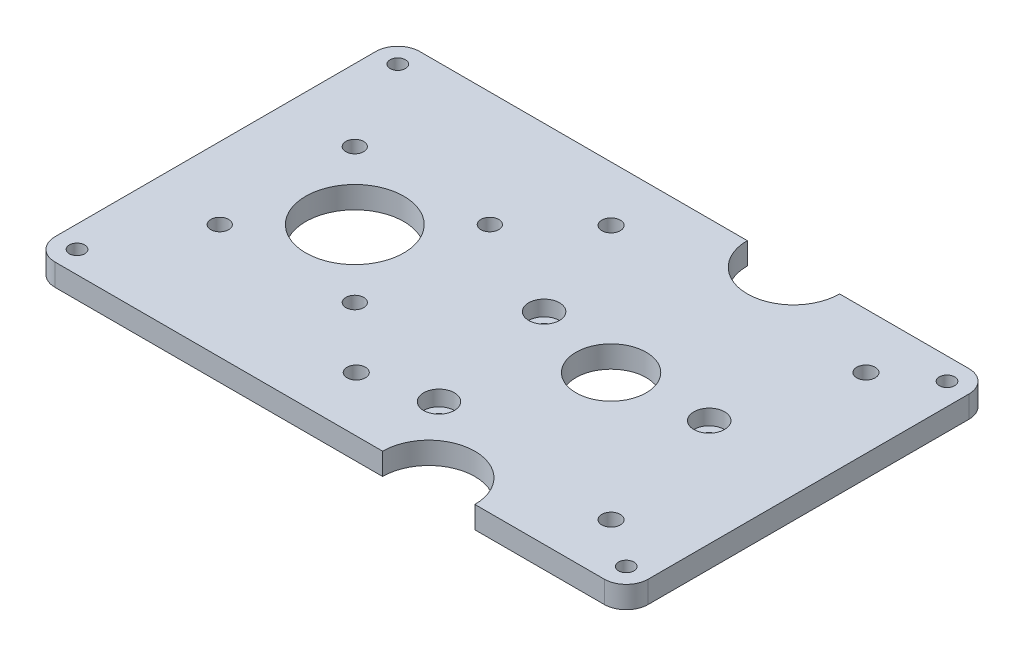
ISO-10303-21;
HEADER;
FILE_DESCRIPTION(('STEP AP214'),'2;1');
FILE_NAME('part.step','',(''),(''),'','','');
FILE_SCHEMA(('AUTOMOTIVE_DESIGN { 1 0 10303 214 1 1 1 1 }'));
ENDSEC;
DATA;
#1=APPLICATION_CONTEXT('core data for automotive mechanical design processes');
#2=APPLICATION_PROTOCOL_DEFINITION('international standard','automotive_design',2000,#1);
#3=PRODUCT_CONTEXT('',#1,'mechanical');
#4=PRODUCT('Part','Part','',(#3));
#5=PRODUCT_RELATED_PRODUCT_CATEGORY('part','',(#4));
#6=PRODUCT_DEFINITION_FORMATION('','',#4);
#7=PRODUCT_DEFINITION_CONTEXT('part definition',#1,'design');
#8=PRODUCT_DEFINITION('design','',#6,#7);
#9=PRODUCT_DEFINITION_SHAPE('','',#8);
#10=(LENGTH_UNIT() NAMED_UNIT(*) SI_UNIT(.MILLI.,.METRE.));
#11=(NAMED_UNIT(*) PLANE_ANGLE_UNIT() SI_UNIT($,.RADIAN.));
#12=(NAMED_UNIT(*) SI_UNIT($,.STERADIAN.) SOLID_ANGLE_UNIT());
#13=UNCERTAINTY_MEASURE_WITH_UNIT(LENGTH_MEASURE(1.E-05),#10,'distance_accuracy_value','');
#14=(GEOMETRIC_REPRESENTATION_CONTEXT(3) GLOBAL_UNCERTAINTY_ASSIGNED_CONTEXT((#13)) GLOBAL_UNIT_ASSIGNED_CONTEXT((#10,
#11,#12)) REPRESENTATION_CONTEXT('',''));
#15=CARTESIAN_POINT('',(0.,0.,0.));
#16=DIRECTION('',(0.,0.,1.));
#17=DIRECTION('',(1.,0.,0.));
#18=AXIS2_PLACEMENT_3D('',#15,#16,#17);
#19=CARTESIAN_POINT('',(8.69931970046473,-5.,25.3178513796003));
#20=DIRECTION('',(0.,1.,0.));
#21=DIRECTION('',(0.,0.,1.));
#22=AXIS2_PLACEMENT_3D('',#19,#20,#21);
#23=CYLINDRICAL_SURFACE('',#22,1.65);
#24=CARTESIAN_POINT('',(8.69931970046473,0.,25.3178513796003));
#25=DIRECTION('',(0.,1.,0.));
#26=DIRECTION('',(0.,0.,1.));
#27=AXIS2_PLACEMENT_3D('',#24,#25,#26);
#28=CIRCLE('',#27,1.65);
#29=CARTESIAN_POINT('',(8.69931970046473,0.,26.9678513796003));
#30=VERTEX_POINT('',#29);
#31=EDGE_CURVE('E313',#30,#30,#28,.T.);
#32=ORIENTED_EDGE('',*,*,#31,.F.);
#33=EDGE_LOOP('',(#32));
#34=FACE_BOUND('',#33,.T.);
#35=CARTESIAN_POINT('',(8.69931970046473,1.5,25.3178513796003));
#36=DIRECTION('',(0.,1.,0.));
#37=DIRECTION('',(0.,0.,1.));
#38=AXIS2_PLACEMENT_3D('',#35,#36,#37);
#39=CIRCLE('',#38,1.65);
#40=CARTESIAN_POINT('',(8.69931970046473,1.5,26.9678513796003));
#41=VERTEX_POINT('',#40);
#42=EDGE_CURVE('E362',#41,#41,#39,.F.);
#43=ORIENTED_EDGE('',*,*,#42,.F.);
#44=EDGE_LOOP('',(#43));
#45=FACE_BOUND('',#44,.T.);
#46=ADVANCED_FACE('F39',(#34,#45),#23,.F.);
#47=CARTESIAN_POINT('',(2.92152234437952,-5.,-4.38401529104274));
#48=DIRECTION('',(0.,1.,0.));
#49=DIRECTION('',(0.,0.,1.));
#50=AXIS2_PLACEMENT_3D('',#47,#48,#49);
#51=CYLINDRICAL_SURFACE('',#50,1.65);
#52=CARTESIAN_POINT('',(2.92152234437952,0.,-4.38401529104274));
#53=DIRECTION('',(0.,1.,0.));
#54=DIRECTION('',(0.,0.,1.));
#55=AXIS2_PLACEMENT_3D('',#52,#53,#54);
#56=CIRCLE('',#55,1.65);
#57=CARTESIAN_POINT('',(2.92152234437952,0.,-2.73401529104274));
#58=VERTEX_POINT('',#57);
#59=EDGE_CURVE('E315',#58,#58,#56,.T.);
#60=ORIENTED_EDGE('',*,*,#59,.F.);
#61=EDGE_LOOP('',(#60));
#62=FACE_BOUND('',#61,.T.);
#63=CARTESIAN_POINT('',(2.92152234437952,1.5,-4.38401529104274));
#64=DIRECTION('',(0.,1.,0.));
#65=DIRECTION('',(0.,0.,1.));
#66=AXIS2_PLACEMENT_3D('',#63,#64,#65);
#67=CIRCLE('',#66,1.65);
#68=CARTESIAN_POINT('',(2.92152234437952,1.5,-2.73401529104274));
#69=VERTEX_POINT('',#68);
#70=EDGE_CURVE('E345',#69,#69,#67,.F.);
#71=ORIENTED_EDGE('',*,*,#70,.F.);
#72=EDGE_LOOP('',(#71));
#73=FACE_BOUND('',#72,.T.);
#74=ADVANCED_FACE('F328',(#62,#73),#51,.F.);
#75=CARTESIAN_POINT('',(43.1993197004647,-5.,-1.68214862039967));
#76=DIRECTION('',(0.,1.,0.));
#77=DIRECTION('',(0.,0.,1.));
#78=AXIS2_PLACEMENT_3D('',#75,#76,#77);
#79=CYLINDRICAL_SURFACE('',#78,1.65);
#80=CARTESIAN_POINT('',(43.1993197004647,0.,-1.68214862039967));
#81=DIRECTION('',(0.,1.,0.));
#82=DIRECTION('',(0.,0.,1.));
#83=AXIS2_PLACEMENT_3D('',#80,#81,#82);
#84=CIRCLE('',#83,1.65);
#85=CARTESIAN_POINT('',(43.1993197004647,0.,-0.0321486203996718));
#86=VERTEX_POINT('',#85);
#87=EDGE_CURVE('E43',#86,#86,#84,.T.);
#88=ORIENTED_EDGE('',*,*,#87,.F.);
#89=EDGE_LOOP('',(#88));
#90=FACE_BOUND('',#89,.T.);
#91=CARTESIAN_POINT('',(43.1993197004647,1.5,-1.68214862039967));
#92=DIRECTION('',(0.,1.,0.));
#93=DIRECTION('',(0.,0.,1.));
#94=AXIS2_PLACEMENT_3D('',#91,#92,#93);
#95=CIRCLE('',#94,1.65);
#96=CARTESIAN_POINT('',(43.1993197004647,1.5,-0.0321486203996718));
#97=VERTEX_POINT('',#96);
#98=EDGE_CURVE('E332',#97,#97,#95,.F.);
#99=ORIENTED_EDGE('',*,*,#98,.F.);
#100=EDGE_LOOP('',(#99));
#101=FACE_BOUND('',#100,.T.);
#102=ADVANCED_FACE('F325',(#90,#101),#79,.F.);
#103=CARTESIAN_POINT('',(22.5500000000001,5.,-41.5));
#104=DIRECTION('',(0.,-1.,0.));
#105=DIRECTION('',(0.,0.,-1.));
#106=AXIS2_PLACEMENT_3D('',#103,#104,#105);
#107=CYLINDRICAL_SURFACE('',#106,10.5);
#108=CARTESIAN_POINT('',(22.5500000000001,0.,-41.5));
#109=DIRECTION('',(0.,1.,0.));
#110=DIRECTION('',(0.,0.,1.));
#111=AXIS2_PLACEMENT_3D('',#108,#109,#110);
#112=CIRCLE('',#111,10.5);
#113=CARTESIAN_POINT('',(12.0500000000001,0.,-41.5));
#114=VERTEX_POINT('',#113);
#115=CARTESIAN_POINT('',(33.0500000000001,0.,-41.5));
#116=VERTEX_POINT('',#115);
#117=EDGE_CURVE('E139',#114,#116,#112,.T.);
#118=ORIENTED_EDGE('',*,*,#117,.F.);
#119=DIRECTION('',(0.,-1.,0.));
#120=VECTOR('',#119,1.);
#121=CARTESIAN_POINT('',(12.0500000000001,5.,-41.5));
#122=LINE('',#121,#120);
#123=CARTESIAN_POINT('',(12.0500000000001,5.,-41.5));
#124=VERTEX_POINT('',#123);
#125=EDGE_CURVE('E132',#124,#114,#122,.T.);
#126=ORIENTED_EDGE('',*,*,#125,.F.);
#127=CARTESIAN_POINT('',(22.5500000000001,5.,-41.5));
#128=DIRECTION('',(0.,1.,0.));
#129=DIRECTION('',(0.,0.,1.));
#130=AXIS2_PLACEMENT_3D('',#127,#128,#129);
#131=CIRCLE('',#130,10.5);
#132=CARTESIAN_POINT('',(33.0500000000001,5.,-41.5));
#133=VERTEX_POINT('',#132);
#134=EDGE_CURVE('E137',#124,#133,#131,.T.);
#135=ORIENTED_EDGE('',*,*,#134,.T.);
#136=DIRECTION('',(0.,-1.,0.));
#137=VECTOR('',#136,1.);
#138=CARTESIAN_POINT('',(33.0500000000001,5.,-41.5));
#139=LINE('',#138,#137);
#140=EDGE_CURVE('E223',#133,#116,#139,.T.);
#141=ORIENTED_EDGE('',*,*,#140,.T.);
#142=EDGE_LOOP('',(#118,#126,#135,#141));
#143=FACE_BOUND('',#142,.T.);
#144=ADVANCED_FACE('F134',(#143),#107,.F.);
#145=CARTESIAN_POINT('',(0.,5.,-41.5));
#146=DIRECTION('',(0.,0.,1.));
#147=DIRECTION('',(1.,0.,0.));
#148=AXIS2_PLACEMENT_3D('',#145,#146,#147);
#149=PLANE('',#148);
#150=DIRECTION('',(-1.,0.,0.));
#151=VECTOR('',#150,1.);
#152=CARTESIAN_POINT('',(0.,0.,-41.5));
#153=LINE('',#152,#151);
#154=CARTESIAN_POINT('',(-62.5,0.,-41.5));
#155=VERTEX_POINT('',#154);
#156=EDGE_CURVE('E225',#114,#155,#153,.T.);
#157=ORIENTED_EDGE('',*,*,#156,.T.);
#158=DIRECTION('',(0.,-1.,0.));
#159=VECTOR('',#158,1.);
#160=CARTESIAN_POINT('',(-62.5,5.,-41.5));
#161=LINE('',#160,#159);
#162=CARTESIAN_POINT('',(-62.5,5.,-41.5));
#163=VERTEX_POINT('',#162);
#164=EDGE_CURVE('E150',#155,#163,#161,.F.);
#165=ORIENTED_EDGE('',*,*,#164,.T.);
#166=DIRECTION('',(-1.,0.,0.));
#167=VECTOR('',#166,1.);
#168=CARTESIAN_POINT('',(0.,5.,-41.5));
#169=LINE('',#168,#167);
#170=EDGE_CURVE('E147',#124,#163,#169,.T.);
#171=ORIENTED_EDGE('',*,*,#170,.F.);
#172=ORIENTED_EDGE('',*,*,#125,.T.);
#173=EDGE_LOOP('',(#157,#165,#171,#172));
#174=FACE_BOUND('',#173,.T.);
#175=ADVANCED_FACE('F148',(#174),#149,.F.);
#176=CARTESIAN_POINT('',(-67.5,5.,0.));
#177=DIRECTION('',(-1.,0.,0.));
#178=DIRECTION('',(0.,0.,1.));
#179=AXIS2_PLACEMENT_3D('',#176,#177,#178);
#180=PLANE('',#179);
#181=DIRECTION('',(0.,0.,-1.));
#182=VECTOR('',#181,1.);
#183=CARTESIAN_POINT('',(-67.5,0.,0.));
#184=LINE('',#183,#182);
#185=CARTESIAN_POINT('',(-67.5,0.,36.5));
#186=VERTEX_POINT('',#185);
#187=CARTESIAN_POINT('',(-67.5,0.,-36.5));
#188=VERTEX_POINT('',#187);
#189=EDGE_CURVE('E227',#186,#188,#184,.T.);
#190=ORIENTED_EDGE('',*,*,#189,.F.);
#191=DIRECTION('',(0.,-1.,0.));
#192=VECTOR('',#191,1.);
#193=CARTESIAN_POINT('',(-67.5,5.,36.5));
#194=LINE('',#193,#192);
#195=CARTESIAN_POINT('',(-67.5,5.,36.5));
#196=VERTEX_POINT('',#195);
#197=EDGE_CURVE('E298',#186,#196,#194,.F.);
#198=ORIENTED_EDGE('',*,*,#197,.T.);
#199=DIRECTION('',(0.,0.,-1.));
#200=VECTOR('',#199,1.);
#201=CARTESIAN_POINT('',(-67.5,5.,0.));
#202=LINE('',#201,#200);
#203=CARTESIAN_POINT('',(-67.5,5.,-36.5));
#204=VERTEX_POINT('',#203);
#205=EDGE_CURVE('E152',#196,#204,#202,.T.);
#206=ORIENTED_EDGE('',*,*,#205,.T.);
#207=DIRECTION('',(0.,-1.,0.));
#208=VECTOR('',#207,1.);
#209=CARTESIAN_POINT('',(-67.5,0.,-36.5));
#210=LINE('',#209,#208);
#211=EDGE_CURVE('E295',#204,#188,#210,.T.);
#212=ORIENTED_EDGE('',*,*,#211,.T.);
#213=EDGE_LOOP('',(#190,#198,#206,#212));
#214=FACE_BOUND('',#213,.T.);
#215=ADVANCED_FACE('F699',(#214),#180,.T.);
#216=CARTESIAN_POINT('',(0.,5.,41.5));
#217=DIRECTION('',(0.,0.,1.));
#218=DIRECTION('',(1.,0.,0.));
#219=AXIS2_PLACEMENT_3D('',#216,#217,#218);
#220=PLANE('',#219);
#221=DIRECTION('',(-1.,0.,0.));
#222=VECTOR('',#221,1.);
#223=CARTESIAN_POINT('',(0.,5.,41.5));
#224=LINE('',#223,#222);
#225=CARTESIAN_POINT('',(12.0500000000001,5.,41.5));
#226=VERTEX_POINT('',#225);
#227=CARTESIAN_POINT('',(-62.5,5.,41.5));
#228=VERTEX_POINT('',#227);
#229=EDGE_CURVE('E170',#226,#228,#224,.T.);
#230=ORIENTED_EDGE('',*,*,#229,.T.);
#231=DIRECTION('',(0.,-1.,0.));
#232=VECTOR('',#231,1.);
#233=CARTESIAN_POINT('',(-62.5,5.,41.5));
#234=LINE('',#233,#232);
#235=CARTESIAN_POINT('',(-62.5,0.,41.5));
#236=VERTEX_POINT('',#235);
#237=EDGE_CURVE('E143',#228,#236,#234,.T.);
#238=ORIENTED_EDGE('',*,*,#237,.T.);
#239=DIRECTION('',(-1.,0.,0.));
#240=VECTOR('',#239,1.);
#241=CARTESIAN_POINT('',(0.,0.,41.5));
#242=LINE('',#241,#240);
#243=CARTESIAN_POINT('',(12.0500000000001,0.,41.5));
#244=VERTEX_POINT('',#243);
#245=EDGE_CURVE('E230',#244,#236,#242,.T.);
#246=ORIENTED_EDGE('',*,*,#245,.F.);
#247=DIRECTION('',(0.,-1.,0.));
#248=VECTOR('',#247,1.);
#249=CARTESIAN_POINT('',(12.0500000000001,5.,41.5));
#250=LINE('',#249,#248);
#251=EDGE_CURVE('E144',#226,#244,#250,.T.);
#252=ORIENTED_EDGE('',*,*,#251,.F.);
#253=EDGE_LOOP('',(#230,#238,#246,#252));
#254=FACE_BOUND('',#253,.T.);
#255=ADVANCED_FACE('F688',(#254),#220,.T.);
#256=CARTESIAN_POINT('',(22.5500000000001,5.,41.5));
#257=DIRECTION('',(0.,-1.,0.));
#258=DIRECTION('',(0.,0.,-1.));
#259=AXIS2_PLACEMENT_3D('',#256,#257,#258);
#260=CYLINDRICAL_SURFACE('',#259,10.5);
#261=CARTESIAN_POINT('',(22.5500000000001,0.,41.5));
#262=DIRECTION('',(0.,1.,0.));
#263=DIRECTION('',(0.,0.,1.));
#264=AXIS2_PLACEMENT_3D('',#261,#262,#263);
#265=CIRCLE('',#264,10.5);
#266=CARTESIAN_POINT('',(33.0500000000001,0.,41.5));
#267=VERTEX_POINT('',#266);
#268=EDGE_CURVE('E233',#267,#244,#265,.T.);
#269=ORIENTED_EDGE('',*,*,#268,.F.);
#270=DIRECTION('',(0.,-1.,0.));
#271=VECTOR('',#270,1.);
#272=CARTESIAN_POINT('',(33.0500000000001,5.,41.5));
#273=LINE('',#272,#271);
#274=CARTESIAN_POINT('',(33.0500000000001,5.,41.5));
#275=VERTEX_POINT('',#274);
#276=EDGE_CURVE('E281',#275,#267,#273,.T.);
#277=ORIENTED_EDGE('',*,*,#276,.F.);
#278=CARTESIAN_POINT('',(22.5500000000001,5.,41.5));
#279=DIRECTION('',(0.,1.,0.));
#280=DIRECTION('',(0.,0.,1.));
#281=AXIS2_PLACEMENT_3D('',#278,#279,#280);
#282=CIRCLE('',#281,10.5);
#283=EDGE_CURVE('E173',#275,#226,#282,.T.);
#284=ORIENTED_EDGE('',*,*,#283,.T.);
#285=ORIENTED_EDGE('',*,*,#251,.T.);
#286=EDGE_LOOP('',(#269,#277,#284,#285));
#287=FACE_BOUND('',#286,.T.);
#288=ADVANCED_FACE('F677',(#287),#260,.F.);
#289=CARTESIAN_POINT('',(0.,5.,41.5));
#290=DIRECTION('',(0.,0.,1.));
#291=DIRECTION('',(1.,0.,0.));
#292=AXIS2_PLACEMENT_3D('',#289,#290,#291);
#293=PLANE('',#292);
#294=DIRECTION('',(-1.,0.,0.));
#295=VECTOR('',#294,1.);
#296=CARTESIAN_POINT('',(0.,0.,41.5));
#297=LINE('',#296,#295);
#298=CARTESIAN_POINT('',(62.5,0.,41.5));
#299=VERTEX_POINT('',#298);
#300=EDGE_CURVE('E236',#299,#267,#297,.T.);
#301=ORIENTED_EDGE('',*,*,#300,.F.);
#302=DIRECTION('',(0.,-1.,0.));
#303=VECTOR('',#302,1.);
#304=CARTESIAN_POINT('',(62.5,5.,41.5));
#305=LINE('',#304,#303);
#306=CARTESIAN_POINT('',(62.5,5.,41.5));
#307=VERTEX_POINT('',#306);
#308=EDGE_CURVE('E48',#299,#307,#305,.F.);
#309=ORIENTED_EDGE('',*,*,#308,.T.);
#310=DIRECTION('',(-1.,0.,0.));
#311=VECTOR('',#310,1.);
#312=CARTESIAN_POINT('',(0.,5.,41.5));
#313=LINE('',#312,#311);
#314=EDGE_CURVE('E176',#307,#275,#313,.T.);
#315=ORIENTED_EDGE('',*,*,#314,.T.);
#316=ORIENTED_EDGE('',*,*,#276,.T.);
#317=EDGE_LOOP('',(#301,#309,#315,#316));
#318=FACE_BOUND('',#317,.T.);
#319=ADVANCED_FACE('F667',(#318),#293,.T.);
#320=CARTESIAN_POINT('',(67.5,5.,0.));
#321=DIRECTION('',(-1.,0.,0.));
#322=DIRECTION('',(0.,0.,1.));
#323=AXIS2_PLACEMENT_3D('',#320,#321,#322);
#324=PLANE('',#323);
#325=DIRECTION('',(0.,0.,-1.));
#326=VECTOR('',#325,1.);
#327=CARTESIAN_POINT('',(67.5,5.,0.));
#328=LINE('',#327,#326);
#329=CARTESIAN_POINT('',(67.5,5.,36.5));
#330=VERTEX_POINT('',#329);
#331=CARTESIAN_POINT('',(67.5,5.,-36.5));
#332=VERTEX_POINT('',#331);
#333=EDGE_CURVE('E178',#330,#332,#328,.T.);
#334=ORIENTED_EDGE('',*,*,#333,.F.);
#335=DIRECTION('',(0.,-1.,0.));
#336=VECTOR('',#335,1.);
#337=CARTESIAN_POINT('',(67.5,0.,36.5));
#338=LINE('',#337,#336);
#339=CARTESIAN_POINT('',(67.5,0.,36.5));
#340=VERTEX_POINT('',#339);
#341=EDGE_CURVE('E309',#330,#340,#338,.T.);
#342=ORIENTED_EDGE('',*,*,#341,.T.);
#343=DIRECTION('',(0.,0.,-1.));
#344=VECTOR('',#343,1.);
#345=CARTESIAN_POINT('',(67.5,0.,0.));
#346=LINE('',#345,#344);
#347=CARTESIAN_POINT('',(67.5,0.,-36.5));
#348=VERTEX_POINT('',#347);
#349=EDGE_CURVE('E238',#340,#348,#346,.T.);
#350=ORIENTED_EDGE('',*,*,#349,.T.);
#351=DIRECTION('',(0.,-1.,0.));
#352=VECTOR('',#351,1.);
#353=CARTESIAN_POINT('',(67.5,5.,-36.5));
#354=LINE('',#353,#352);
#355=EDGE_CURVE('E64',#348,#332,#354,.F.);
#356=ORIENTED_EDGE('',*,*,#355,.T.);
#357=EDGE_LOOP('',(#334,#342,#350,#356));
#358=FACE_BOUND('',#357,.T.);
#359=ADVANCED_FACE('F656',(#358),#324,.F.);
#360=CARTESIAN_POINT('',(62.5,5.,36.5));
#361=DIRECTION('',(0.,-1.,0.));
#362=DIRECTION('',(0.,0.,-1.));
#363=AXIS2_PLACEMENT_3D('',#360,#361,#362);
#364=CYLINDRICAL_SURFACE('',#363,1.75);
#365=CARTESIAN_POINT('',(62.5,5.,36.5));
#366=DIRECTION('',(0.,1.,0.));
#367=DIRECTION('',(0.,0.,1.));
#368=AXIS2_PLACEMENT_3D('',#365,#366,#367);
#369=CIRCLE('',#368,1.75);
#370=CARTESIAN_POINT('',(62.5,5.,38.25));
#371=VERTEX_POINT('',#370);
#372=EDGE_CURVE('E217',#371,#371,#369,.T.);
#373=ORIENTED_EDGE('',*,*,#372,.T.);
#374=EDGE_LOOP('',(#373));
#375=FACE_BOUND('',#374,.T.);
#376=CARTESIAN_POINT('',(62.5,0.,36.5));
#377=DIRECTION('',(0.,1.,0.));
#378=DIRECTION('',(0.,0.,1.));
#379=AXIS2_PLACEMENT_3D('',#376,#377,#378);
#380=CIRCLE('',#379,1.75);
#381=CARTESIAN_POINT('',(62.5,0.,38.25));
#382=VERTEX_POINT('',#381);
#383=EDGE_CURVE('E162',#382,#382,#380,.T.);
#384=ORIENTED_EDGE('',*,*,#383,.F.);
#385=EDGE_LOOP('',(#384));
#386=FACE_BOUND('',#385,.T.);
#387=ADVANCED_FACE('F645',(#375,#386),#364,.F.);
#388=CARTESIAN_POINT('',(-35.78,5.,0.));
#389=DIRECTION('',(0.,-1.,0.));
#390=DIRECTION('',(0.,0.,-1.));
#391=AXIS2_PLACEMENT_3D('',#388,#389,#390);
#392=CYLINDRICAL_SURFACE('',#391,11.176);
#393=CARTESIAN_POINT('',(-35.78,5.,0.));
#394=DIRECTION('',(0.,1.,0.));
#395=DIRECTION('',(0.,0.,1.));
#396=AXIS2_PLACEMENT_3D('',#393,#394,#395);
#397=CIRCLE('',#396,11.176);
#398=CARTESIAN_POINT('',(-35.78,5.,11.176));
#399=VERTEX_POINT('',#398);
#400=EDGE_CURVE('E214',#399,#399,#397,.F.);
#401=ORIENTED_EDGE('',*,*,#400,.F.);
#402=EDGE_LOOP('',(#401));
#403=FACE_BOUND('',#402,.T.);
#404=CARTESIAN_POINT('',(-35.78,0.,0.));
#405=DIRECTION('',(0.,1.,0.));
#406=DIRECTION('',(0.,0.,1.));
#407=AXIS2_PLACEMENT_3D('',#404,#405,#406);
#408=CIRCLE('',#407,11.176);
#409=CARTESIAN_POINT('',(-35.78,0.,11.176));
#410=VERTEX_POINT('',#409);
#411=EDGE_CURVE('E275',#410,#410,#408,.F.);
#412=ORIENTED_EDGE('',*,*,#411,.T.);
#413=EDGE_LOOP('',(#412));
#414=FACE_BOUND('',#413,.T.);
#415=ADVANCED_FACE('F634',(#403,#414),#392,.F.);
#416=CARTESIAN_POINT('',(22.5500000000001,5.,0.));
#417=DIRECTION('',(0.,-1.,0.));
#418=DIRECTION('',(0.,0.,-1.));
#419=AXIS2_PLACEMENT_3D('',#416,#417,#418);
#420=CYLINDRICAL_SURFACE('',#419,8.00000000000001);
#421=CARTESIAN_POINT('',(22.5500000000001,5.,0.));
#422=DIRECTION('',(0.,1.,0.));
#423=DIRECTION('',(0.,0.,1.));
#424=AXIS2_PLACEMENT_3D('',#421,#422,#423);
#425=CIRCLE('',#424,8.00000000000001);
#426=CARTESIAN_POINT('',(22.5500000000001,5.,8.00000000000001));
#427=VERTEX_POINT('',#426);
#428=EDGE_CURVE('E211',#427,#427,#425,.T.);
#429=ORIENTED_EDGE('',*,*,#428,.T.);
#430=EDGE_LOOP('',(#429));
#431=FACE_BOUND('',#430,.T.);
#432=CARTESIAN_POINT('',(22.5500000000001,0.,0.));
#433=DIRECTION('',(0.,1.,0.));
#434=DIRECTION('',(0.,0.,1.));
#435=AXIS2_PLACEMENT_3D('',#432,#433,#434);
#436=CIRCLE('',#435,8.00000000000001);
#437=CARTESIAN_POINT('',(22.5500000000001,0.,8.00000000000001));
#438=VERTEX_POINT('',#437);
#439=EDGE_CURVE('E272',#438,#438,#436,.T.);
#440=ORIENTED_EDGE('',*,*,#439,.F.);
#441=EDGE_LOOP('',(#440));
#442=FACE_BOUND('',#441,.T.);
#443=ADVANCED_FACE('F623',(#431,#442),#420,.F.);
#444=CARTESIAN_POINT('',(-6.44999999999989,5.,29.));
#445=DIRECTION('',(0.,-1.,0.));
#446=DIRECTION('',(0.,0.,-1.));
#447=AXIS2_PLACEMENT_3D('',#444,#445,#446);
#448=CYLINDRICAL_SURFACE('',#447,2.09999999999999);
#449=CARTESIAN_POINT('',(-6.44999999999989,5.,29.));
#450=DIRECTION('',(0.,1.,0.));
#451=DIRECTION('',(0.,0.,1.));
#452=AXIS2_PLACEMENT_3D('',#449,#450,#451);
#453=CIRCLE('',#452,2.09999999999999);
#454=CARTESIAN_POINT('',(-6.44999999999989,5.,31.1));
#455=VERTEX_POINT('',#454);
#456=EDGE_CURVE('E208',#455,#455,#453,.T.);
#457=ORIENTED_EDGE('',*,*,#456,.T.);
#458=EDGE_LOOP('',(#457));
#459=FACE_BOUND('',#458,.T.);
#460=CARTESIAN_POINT('',(-6.44999999999989,0.,29.));
#461=DIRECTION('',(0.,1.,0.));
#462=DIRECTION('',(0.,0.,1.));
#463=AXIS2_PLACEMENT_3D('',#460,#461,#462);
#464=CIRCLE('',#463,2.09999999999999);
#465=CARTESIAN_POINT('',(-6.44999999999989,0.,31.1));
#466=VERTEX_POINT('',#465);
#467=EDGE_CURVE('E269',#466,#466,#464,.T.);
#468=ORIENTED_EDGE('',*,*,#467,.F.);
#469=EDGE_LOOP('',(#468));
#470=FACE_BOUND('',#469,.T.);
#471=ADVANCED_FACE('F612',(#459,#470),#448,.F.);
#472=CARTESIAN_POINT('',(51.5500000000001,5.,29.));
#473=DIRECTION('',(0.,-1.,0.));
#474=DIRECTION('',(0.,0.,-1.));
#475=AXIS2_PLACEMENT_3D('',#472,#473,#474);
#476=CYLINDRICAL_SURFACE('',#475,2.1);
#477=CARTESIAN_POINT('',(51.5500000000001,5.,29.));
#478=DIRECTION('',(0.,1.,0.));
#479=DIRECTION('',(0.,0.,1.));
#480=AXIS2_PLACEMENT_3D('',#477,#478,#479);
#481=CIRCLE('',#480,2.1);
#482=CARTESIAN_POINT('',(51.5500000000001,5.,31.1));
#483=VERTEX_POINT('',#482);
#484=EDGE_CURVE('E205',#483,#483,#481,.T.);
#485=ORIENTED_EDGE('',*,*,#484,.T.);
#486=EDGE_LOOP('',(#485));
#487=FACE_BOUND('',#486,.T.);
#488=CARTESIAN_POINT('',(51.5500000000001,0.,29.));
#489=DIRECTION('',(0.,1.,0.));
#490=DIRECTION('',(0.,0.,1.));
#491=AXIS2_PLACEMENT_3D('',#488,#489,#490);
#492=CIRCLE('',#491,2.1);
#493=CARTESIAN_POINT('',(51.5500000000001,0.,31.1));
#494=VERTEX_POINT('',#493);
#495=EDGE_CURVE('E266',#494,#494,#492,.T.);
#496=ORIENTED_EDGE('',*,*,#495,.F.);
#497=EDGE_LOOP('',(#496));
#498=FACE_BOUND('',#497,.T.);
#499=ADVANCED_FACE('F601',(#487,#498),#476,.F.);
#500=CARTESIAN_POINT('',(51.5500000000001,5.,-29.));
#501=DIRECTION('',(0.,-1.,0.));
#502=DIRECTION('',(0.,0.,-1.));
#503=AXIS2_PLACEMENT_3D('',#500,#501,#502);
#504=CYLINDRICAL_SURFACE('',#503,2.1);
#505=CARTESIAN_POINT('',(51.5500000000001,5.,-29.));
#506=DIRECTION('',(0.,1.,0.));
#507=DIRECTION('',(0.,0.,1.));
#508=AXIS2_PLACEMENT_3D('',#505,#506,#507);
#509=CIRCLE('',#508,2.1);
#510=CARTESIAN_POINT('',(51.5500000000001,5.,-26.9));
#511=VERTEX_POINT('',#510);
#512=EDGE_CURVE('E202',#511,#511,#509,.T.);
#513=ORIENTED_EDGE('',*,*,#512,.T.);
#514=EDGE_LOOP('',(#513));
#515=FACE_BOUND('',#514,.T.);
#516=CARTESIAN_POINT('',(51.5500000000001,0.,-29.));
#517=DIRECTION('',(0.,1.,0.));
#518=DIRECTION('',(0.,0.,1.));
#519=AXIS2_PLACEMENT_3D('',#516,#517,#518);
#520=CIRCLE('',#519,2.1);
#521=CARTESIAN_POINT('',(51.5500000000001,0.,-26.9));
#522=VERTEX_POINT('',#521);
#523=EDGE_CURVE('E263',#522,#522,#520,.T.);
#524=ORIENTED_EDGE('',*,*,#523,.F.);
#525=EDGE_LOOP('',(#524));
#526=FACE_BOUND('',#525,.T.);
#527=ADVANCED_FACE('F590',(#515,#526),#504,.F.);
#528=CARTESIAN_POINT('',(-6.44999999999988,5.,-29.));
#529=DIRECTION('',(0.,-1.,0.));
#530=DIRECTION('',(0.,0.,-1.));
#531=AXIS2_PLACEMENT_3D('',#528,#529,#530);
#532=CYLINDRICAL_SURFACE('',#531,2.09999999999999);
#533=CARTESIAN_POINT('',(-6.44999999999988,5.,-29.));
#534=DIRECTION('',(0.,1.,0.));
#535=DIRECTION('',(0.,0.,1.));
#536=AXIS2_PLACEMENT_3D('',#533,#534,#535);
#537=CIRCLE('',#536,2.09999999999999);
#538=CARTESIAN_POINT('',(-6.44999999999988,5.,-26.9));
#539=VERTEX_POINT('',#538);
#540=EDGE_CURVE('E199',#539,#539,#537,.T.);
#541=ORIENTED_EDGE('',*,*,#540,.T.);
#542=EDGE_LOOP('',(#541));
#543=FACE_BOUND('',#542,.T.);
#544=CARTESIAN_POINT('',(-6.44999999999988,0.,-29.));
#545=DIRECTION('',(0.,1.,0.));
#546=DIRECTION('',(0.,0.,1.));
#547=AXIS2_PLACEMENT_3D('',#544,#545,#546);
#548=CIRCLE('',#547,2.09999999999999);
#549=CARTESIAN_POINT('',(-6.44999999999988,0.,-26.9));
#550=VERTEX_POINT('',#549);
#551=EDGE_CURVE('E260',#550,#550,#548,.T.);
#552=ORIENTED_EDGE('',*,*,#551,.F.);
#553=EDGE_LOOP('',(#552));
#554=FACE_BOUND('',#553,.T.);
#555=ADVANCED_FACE('F579',(#543,#554),#532,.F.);
#556=CARTESIAN_POINT('',(-62.5,5.,-36.5));
#557=DIRECTION('',(0.,-1.,0.));
#558=DIRECTION('',(0.,0.,-1.));
#559=AXIS2_PLACEMENT_3D('',#556,#557,#558);
#560=CYLINDRICAL_SURFACE('',#559,1.75);
#561=CARTESIAN_POINT('',(-62.5,5.,-36.5));
#562=DIRECTION('',(0.,1.,0.));
#563=DIRECTION('',(0.,0.,1.));
#564=AXIS2_PLACEMENT_3D('',#561,#562,#563);
#565=CIRCLE('',#564,1.75);
#566=CARTESIAN_POINT('',(-62.5,5.,-34.75));
#567=VERTEX_POINT('',#566);
#568=EDGE_CURVE('E196',#567,#567,#565,.T.);
#569=ORIENTED_EDGE('',*,*,#568,.T.);
#570=EDGE_LOOP('',(#569));
#571=FACE_BOUND('',#570,.T.);
#572=CARTESIAN_POINT('',(-62.5,0.,-36.5));
#573=DIRECTION('',(0.,1.,0.));
#574=DIRECTION('',(0.,0.,1.));
#575=AXIS2_PLACEMENT_3D('',#572,#573,#574);
#576=CIRCLE('',#575,1.75);
#577=CARTESIAN_POINT('',(-62.5,0.,-34.75));
#578=VERTEX_POINT('',#577);
#579=EDGE_CURVE('E257',#578,#578,#576,.T.);
#580=ORIENTED_EDGE('',*,*,#579,.F.);
#581=EDGE_LOOP('',(#580));
#582=FACE_BOUND('',#581,.T.);
#583=ADVANCED_FACE('F568',(#571,#582),#560,.F.);
#584=CARTESIAN_POINT('',(62.5,5.,-36.5));
#585=DIRECTION('',(0.,-1.,0.));
#586=DIRECTION('',(0.,0.,-1.));
#587=AXIS2_PLACEMENT_3D('',#584,#585,#586);
#588=CYLINDRICAL_SURFACE('',#587,1.75);
#589=CARTESIAN_POINT('',(62.5,5.,-36.5));
#590=DIRECTION('',(0.,1.,0.));
#591=DIRECTION('',(0.,0.,1.));
#592=AXIS2_PLACEMENT_3D('',#589,#590,#591);
#593=CIRCLE('',#592,1.75);
#594=CARTESIAN_POINT('',(62.5,5.,-34.75));
#595=VERTEX_POINT('',#594);
#596=EDGE_CURVE('E193',#595,#595,#593,.F.);
#597=ORIENTED_EDGE('',*,*,#596,.F.);
#598=EDGE_LOOP('',(#597));
#599=FACE_BOUND('',#598,.T.);
#600=CARTESIAN_POINT('',(62.5,0.,-36.5));
#601=DIRECTION('',(0.,1.,0.));
#602=DIRECTION('',(0.,0.,1.));
#603=AXIS2_PLACEMENT_3D('',#600,#601,#602);
#604=CIRCLE('',#603,1.75);
#605=CARTESIAN_POINT('',(62.5,0.,-34.75));
#606=VERTEX_POINT('',#605);
#607=EDGE_CURVE('E254',#606,#606,#604,.F.);
#608=ORIENTED_EDGE('',*,*,#607,.T.);
#609=EDGE_LOOP('',(#608));
#610=FACE_BOUND('',#609,.T.);
#611=ADVANCED_FACE('F557',(#599,#610),#588,.F.);
#612=CARTESIAN_POINT('',(-20.413,5.,-15.367));
#613=DIRECTION('',(0.,-1.,0.));
#614=DIRECTION('',(0.,0.,-1.));
#615=AXIS2_PLACEMENT_3D('',#612,#613,#614);
#616=CYLINDRICAL_SURFACE('',#615,2.032);
#617=CARTESIAN_POINT('',(-20.413,5.,-15.367));
#618=DIRECTION('',(0.,1.,0.));
#619=DIRECTION('',(0.,0.,1.));
#620=AXIS2_PLACEMENT_3D('',#617,#618,#619);
#621=CIRCLE('',#620,2.032);
#622=CARTESIAN_POINT('',(-20.413,5.,-13.335));
#623=VERTEX_POINT('',#622);
#624=EDGE_CURVE('E190',#623,#623,#621,.T.);
#625=ORIENTED_EDGE('',*,*,#624,.T.);
#626=EDGE_LOOP('',(#625));
#627=FACE_BOUND('',#626,.T.);
#628=CARTESIAN_POINT('',(-20.413,0.,-15.367));
#629=DIRECTION('',(0.,1.,0.));
#630=DIRECTION('',(0.,0.,1.));
#631=AXIS2_PLACEMENT_3D('',#628,#629,#630);
#632=CIRCLE('',#631,2.032);
#633=CARTESIAN_POINT('',(-20.413,0.,-13.335));
#634=VERTEX_POINT('',#633);
#635=EDGE_CURVE('E251',#634,#634,#632,.T.);
#636=ORIENTED_EDGE('',*,*,#635,.F.);
#637=EDGE_LOOP('',(#636));
#638=FACE_BOUND('',#637,.T.);
#639=ADVANCED_FACE('F546',(#627,#638),#616,.F.);
#640=CARTESIAN_POINT('',(-20.413,5.,15.367));
#641=DIRECTION('',(0.,-1.,0.));
#642=DIRECTION('',(0.,0.,-1.));
#643=AXIS2_PLACEMENT_3D('',#640,#641,#642);
#644=CYLINDRICAL_SURFACE('',#643,2.032);
#645=CARTESIAN_POINT('',(-20.413,5.,15.367));
#646=DIRECTION('',(0.,1.,0.));
#647=DIRECTION('',(0.,0.,1.));
#648=AXIS2_PLACEMENT_3D('',#645,#646,#647);
#649=CIRCLE('',#648,2.032);
#650=CARTESIAN_POINT('',(-20.413,5.,17.399));
#651=VERTEX_POINT('',#650);
#652=EDGE_CURVE('E187',#651,#651,#649,.T.);
#653=ORIENTED_EDGE('',*,*,#652,.T.);
#654=EDGE_LOOP('',(#653));
#655=FACE_BOUND('',#654,.T.);
#656=CARTESIAN_POINT('',(-20.413,0.,15.367));
#657=DIRECTION('',(0.,1.,0.));
#658=DIRECTION('',(0.,0.,1.));
#659=AXIS2_PLACEMENT_3D('',#656,#657,#658);
#660=CIRCLE('',#659,2.032);
#661=CARTESIAN_POINT('',(-20.413,0.,17.399));
#662=VERTEX_POINT('',#661);
#663=EDGE_CURVE('E248',#662,#662,#660,.T.);
#664=ORIENTED_EDGE('',*,*,#663,.F.);
#665=EDGE_LOOP('',(#664));
#666=FACE_BOUND('',#665,.T.);
#667=ADVANCED_FACE('F535',(#655,#666),#644,.F.);
#668=CARTESIAN_POINT('',(-51.147,5.,15.367));
#669=DIRECTION('',(0.,-1.,0.));
#670=DIRECTION('',(0.,0.,-1.));
#671=AXIS2_PLACEMENT_3D('',#668,#669,#670);
#672=CYLINDRICAL_SURFACE('',#671,2.032);
#673=CARTESIAN_POINT('',(-51.147,5.,15.367));
#674=DIRECTION('',(0.,1.,0.));
#675=DIRECTION('',(0.,0.,1.));
#676=AXIS2_PLACEMENT_3D('',#673,#674,#675);
#677=CIRCLE('',#676,2.032);
#678=CARTESIAN_POINT('',(-51.147,5.,17.399));
#679=VERTEX_POINT('',#678);
#680=EDGE_CURVE('E184',#679,#679,#677,.T.);
#681=ORIENTED_EDGE('',*,*,#680,.T.);
#682=EDGE_LOOP('',(#681));
#683=FACE_BOUND('',#682,.T.);
#684=CARTESIAN_POINT('',(-51.147,0.,15.367));
#685=DIRECTION('',(0.,1.,0.));
#686=DIRECTION('',(0.,0.,1.));
#687=AXIS2_PLACEMENT_3D('',#684,#685,#686);
#688=CIRCLE('',#687,2.032);
#689=CARTESIAN_POINT('',(-51.147,0.,17.399));
#690=VERTEX_POINT('',#689);
#691=EDGE_CURVE('E245',#690,#690,#688,.T.);
#692=ORIENTED_EDGE('',*,*,#691,.F.);
#693=EDGE_LOOP('',(#692));
#694=FACE_BOUND('',#693,.T.);
#695=ADVANCED_FACE('F524',(#683,#694),#672,.F.);
#696=CARTESIAN_POINT('',(-51.147,5.,-15.367));
#697=DIRECTION('',(0.,-1.,0.));
#698=DIRECTION('',(0.,0.,-1.));
#699=AXIS2_PLACEMENT_3D('',#696,#697,#698);
#700=CYLINDRICAL_SURFACE('',#699,2.032);
#701=CARTESIAN_POINT('',(-51.147,5.,-15.367));
#702=DIRECTION('',(0.,1.,0.));
#703=DIRECTION('',(0.,0.,1.));
#704=AXIS2_PLACEMENT_3D('',#701,#702,#703);
#705=CIRCLE('',#704,2.032);
#706=CARTESIAN_POINT('',(-51.147,5.,-13.335));
#707=VERTEX_POINT('',#706);
#708=EDGE_CURVE('E181',#707,#707,#705,.T.);
#709=ORIENTED_EDGE('',*,*,#708,.T.);
#710=EDGE_LOOP('',(#709));
#711=FACE_BOUND('',#710,.T.);
#712=CARTESIAN_POINT('',(-51.147,0.,-15.367));
#713=DIRECTION('',(0.,1.,0.));
#714=DIRECTION('',(0.,0.,1.));
#715=AXIS2_PLACEMENT_3D('',#712,#713,#714);
#716=CIRCLE('',#715,2.032);
#717=CARTESIAN_POINT('',(-51.147,0.,-13.335));
#718=VERTEX_POINT('',#717);
#719=EDGE_CURVE('E242',#718,#718,#716,.T.);
#720=ORIENTED_EDGE('',*,*,#719,.F.);
#721=EDGE_LOOP('',(#720));
#722=FACE_BOUND('',#721,.T.);
#723=ADVANCED_FACE('F513',(#711,#722),#700,.F.);
#724=CARTESIAN_POINT('',(0.,5.,-41.5));
#725=DIRECTION('',(0.,0.,1.));
#726=DIRECTION('',(1.,0.,0.));
#727=AXIS2_PLACEMENT_3D('',#724,#725,#726);
#728=PLANE('',#727);
#729=DIRECTION('',(-1.,0.,0.));
#730=VECTOR('',#729,1.);
#731=CARTESIAN_POINT('',(0.,5.,-41.5));
#732=LINE('',#731,#730);
#733=CARTESIAN_POINT('',(62.5,5.,-41.5));
#734=VERTEX_POINT('',#733);
#735=EDGE_CURVE('E157',#734,#133,#732,.T.);
#736=ORIENTED_EDGE('',*,*,#735,.F.);
#737=DIRECTION('',(0.,-1.,0.));
#738=VECTOR('',#737,1.);
#739=CARTESIAN_POINT('',(62.5,5.,-41.5));
#740=LINE('',#739,#738);
#741=CARTESIAN_POINT('',(62.5,0.,-41.5));
#742=VERTEX_POINT('',#741);
#743=EDGE_CURVE('E11',#734,#742,#740,.T.);
#744=ORIENTED_EDGE('',*,*,#743,.T.);
#745=DIRECTION('',(-1.,0.,0.));
#746=VECTOR('',#745,1.);
#747=CARTESIAN_POINT('',(0.,0.,-41.5));
#748=LINE('',#747,#746);
#749=EDGE_CURVE('E240',#742,#116,#748,.T.);
#750=ORIENTED_EDGE('',*,*,#749,.T.);
#751=ORIENTED_EDGE('',*,*,#140,.F.);
#752=EDGE_LOOP('',(#736,#744,#750,#751));
#753=FACE_BOUND('',#752,.T.);
#754=ADVANCED_FACE('F384',(#753),#728,.F.);
#755=CARTESIAN_POINT('',(-62.5,5.,36.5));
#756=DIRECTION('',(0.,-1.,0.));
#757=DIRECTION('',(0.,0.,-1.));
#758=AXIS2_PLACEMENT_3D('',#755,#756,#757);
#759=CYLINDRICAL_SURFACE('',#758,1.75);
#760=CARTESIAN_POINT('',(-62.5,5.,36.5));
#761=DIRECTION('',(0.,1.,0.));
#762=DIRECTION('',(0.,0.,1.));
#763=AXIS2_PLACEMENT_3D('',#760,#761,#762);
#764=CIRCLE('',#763,1.75);
#765=CARTESIAN_POINT('',(-62.5,5.,38.25));
#766=VERTEX_POINT('',#765);
#767=EDGE_CURVE('E220',#766,#766,#764,.F.);
#768=ORIENTED_EDGE('',*,*,#767,.F.);
#769=EDGE_LOOP('',(#768));
#770=FACE_BOUND('',#769,.T.);
#771=CARTESIAN_POINT('',(-62.5,0.,36.5));
#772=DIRECTION('',(0.,1.,0.));
#773=DIRECTION('',(0.,0.,1.));
#774=AXIS2_PLACEMENT_3D('',#771,#772,#773);
#775=CIRCLE('',#774,1.75);
#776=CARTESIAN_POINT('',(-62.5,0.,38.25));
#777=VERTEX_POINT('',#776);
#778=EDGE_CURVE('E159',#777,#777,#775,.F.);
#779=ORIENTED_EDGE('',*,*,#778,.T.);
#780=EDGE_LOOP('',(#779));
#781=FACE_BOUND('',#780,.T.);
#782=ADVANCED_FACE('F375',(#770,#781),#759,.F.);
#783=CARTESIAN_POINT('',(0.,5.,0.));
#784=DIRECTION('',(0.,1.,0.));
#785=DIRECTION('',(0.,0.,1.));
#786=AXIS2_PLACEMENT_3D('',#783,#784,#785);
#787=PLANE('',#786);
#788=CARTESIAN_POINT('',(43.1993197004647,5.,-1.68214862039967));
#789=DIRECTION('',(0.,1.,0.));
#790=DIRECTION('',(0.,0.,1.));
#791=AXIS2_PLACEMENT_3D('',#788,#789,#790);
#792=CIRCLE('',#791,3.5);
#793=CARTESIAN_POINT('',(43.1993197004647,5.,1.81785137960033));
#794=VERTEX_POINT('',#793);
#795=EDGE_CURVE('E335',#794,#794,#792,.T.);
#796=ORIENTED_EDGE('',*,*,#795,.F.);
#797=EDGE_LOOP('',(#796));
#798=FACE_BOUND('',#797,.T.);
#799=CARTESIAN_POINT('',(8.69931970046473,5.,25.3178513796003));
#800=DIRECTION('',(0.,1.,0.));
#801=DIRECTION('',(0.,0.,1.));
#802=AXIS2_PLACEMENT_3D('',#799,#800,#801);
#803=CIRCLE('',#802,3.5);
#804=CARTESIAN_POINT('',(8.69931970046473,5.,28.8178513796003));
#805=VERTEX_POINT('',#804);
#806=EDGE_CURVE('E338',#805,#805,#803,.T.);
#807=ORIENTED_EDGE('',*,*,#806,.F.);
#808=EDGE_LOOP('',(#807));
#809=FACE_BOUND('',#808,.T.);
#810=CARTESIAN_POINT('',(2.92152234437952,5.,-4.38401529104274));
#811=DIRECTION('',(0.,1.,0.));
#812=DIRECTION('',(0.,0.,1.));
#813=AXIS2_PLACEMENT_3D('',#810,#811,#812);
#814=CIRCLE('',#813,3.5);
#815=CARTESIAN_POINT('',(2.92152234437952,5.,-0.884015291042736));
#816=VERTEX_POINT('',#815);
#817=EDGE_CURVE('E165',#816,#816,#814,.T.);
#818=ORIENTED_EDGE('',*,*,#817,.F.);
#819=EDGE_LOOP('',(#818));
#820=FACE_BOUND('',#819,.T.);
#821=ORIENTED_EDGE('',*,*,#205,.F.);
#822=CARTESIAN_POINT('',(-62.5,5.,36.5));
#823=DIRECTION('',(0.,1.,0.));
#824=DIRECTION('',(0.,0.,1.));
#825=AXIS2_PLACEMENT_3D('',#822,#823,#824);
#826=CIRCLE('',#825,5.);
#827=EDGE_CURVE('E305',#196,#228,#826,.T.);
#828=ORIENTED_EDGE('',*,*,#827,.T.);
#829=ORIENTED_EDGE('',*,*,#229,.F.);
#830=ORIENTED_EDGE('',*,*,#283,.F.);
#831=ORIENTED_EDGE('',*,*,#314,.F.);
#832=CARTESIAN_POINT('',(62.5,5.,36.5));
#833=DIRECTION('',(0.,1.,0.));
#834=DIRECTION('',(0.,0.,1.));
#835=AXIS2_PLACEMENT_3D('',#832,#833,#834);
#836=CIRCLE('',#835,5.);
#837=EDGE_CURVE('E301',#307,#330,#836,.T.);
#838=ORIENTED_EDGE('',*,*,#837,.T.);
#839=ORIENTED_EDGE('',*,*,#333,.T.);
#840=CARTESIAN_POINT('',(62.5,5.,-36.5));
#841=DIRECTION('',(0.,1.,0.));
#842=DIRECTION('',(0.,0.,1.));
#843=AXIS2_PLACEMENT_3D('',#840,#841,#842);
#844=CIRCLE('',#843,5.);
#845=EDGE_CURVE('E56',#332,#734,#844,.T.);
#846=ORIENTED_EDGE('',*,*,#845,.T.);
#847=ORIENTED_EDGE('',*,*,#735,.T.);
#848=ORIENTED_EDGE('',*,*,#134,.F.);
#849=ORIENTED_EDGE('',*,*,#170,.T.);
#850=CARTESIAN_POINT('',(-62.5,5.,-36.5));
#851=DIRECTION('',(0.,1.,0.));
#852=DIRECTION('',(0.,0.,1.));
#853=AXIS2_PLACEMENT_3D('',#850,#851,#852);
#854=CIRCLE('',#853,5.);
#855=EDGE_CURVE('E303',#163,#204,#854,.T.);
#856=ORIENTED_EDGE('',*,*,#855,.T.);
#857=EDGE_LOOP('',(#821,#828,#829,#830,#831,#838,#839,#846,#847,#848,#849,#856));
#858=FACE_BOUND('',#857,.T.);
#859=ORIENTED_EDGE('',*,*,#708,.F.);
#860=EDGE_LOOP('',(#859));
#861=FACE_BOUND('',#860,.T.);
#862=ORIENTED_EDGE('',*,*,#680,.F.);
#863=EDGE_LOOP('',(#862));
#864=FACE_BOUND('',#863,.T.);
#865=ORIENTED_EDGE('',*,*,#652,.F.);
#866=EDGE_LOOP('',(#865));
#867=FACE_BOUND('',#866,.T.);
#868=ORIENTED_EDGE('',*,*,#624,.F.);
#869=EDGE_LOOP('',(#868));
#870=FACE_BOUND('',#869,.T.);
#871=ORIENTED_EDGE('',*,*,#596,.T.);
#872=EDGE_LOOP('',(#871));
#873=FACE_BOUND('',#872,.T.);
#874=ORIENTED_EDGE('',*,*,#568,.F.);
#875=EDGE_LOOP('',(#874));
#876=FACE_BOUND('',#875,.T.);
#877=ORIENTED_EDGE('',*,*,#540,.F.);
#878=EDGE_LOOP('',(#877));
#879=FACE_BOUND('',#878,.T.);
#880=ORIENTED_EDGE('',*,*,#512,.F.);
#881=EDGE_LOOP('',(#880));
#882=FACE_BOUND('',#881,.T.);
#883=ORIENTED_EDGE('',*,*,#484,.F.);
#884=EDGE_LOOP('',(#883));
#885=FACE_BOUND('',#884,.T.);
#886=ORIENTED_EDGE('',*,*,#456,.F.);
#887=EDGE_LOOP('',(#886));
#888=FACE_BOUND('',#887,.T.);
#889=ORIENTED_EDGE('',*,*,#428,.F.);
#890=EDGE_LOOP('',(#889));
#891=FACE_BOUND('',#890,.T.);
#892=ORIENTED_EDGE('',*,*,#400,.T.);
#893=EDGE_LOOP('',(#892));
#894=FACE_BOUND('',#893,.T.);
#895=ORIENTED_EDGE('',*,*,#372,.F.);
#896=EDGE_LOOP('',(#895));
#897=FACE_BOUND('',#896,.T.);
#898=ORIENTED_EDGE('',*,*,#767,.T.);
#899=EDGE_LOOP('',(#898));
#900=FACE_BOUND('',#899,.T.);
#901=ADVANCED_FACE('F155',(#798,#809,#820,#858,#861,#864,#867,#870,#873,#876,#879,#882,#885,
#888,#891,#894,#897,#900),#787,.T.);
#902=CARTESIAN_POINT('',(0.,0.,0.));
#903=DIRECTION('',(0.,1.,0.));
#904=DIRECTION('',(0.,0.,1.));
#905=AXIS2_PLACEMENT_3D('',#902,#903,#904);
#906=PLANE('',#905);
#907=ORIENTED_EDGE('',*,*,#87,.T.);
#908=EDGE_LOOP('',(#907));
#909=FACE_BOUND('',#908,.T.);
#910=ORIENTED_EDGE('',*,*,#59,.T.);
#911=EDGE_LOOP('',(#910));
#912=FACE_BOUND('',#911,.T.);
#913=ORIENTED_EDGE('',*,*,#31,.T.);
#914=EDGE_LOOP('',(#913));
#915=FACE_BOUND('',#914,.T.);
#916=ORIENTED_EDGE('',*,*,#245,.T.);
#917=CARTESIAN_POINT('',(-62.5,0.,36.5));
#918=DIRECTION('',(0.,1.,0.));
#919=DIRECTION('',(0.,0.,1.));
#920=AXIS2_PLACEMENT_3D('',#917,#918,#919);
#921=CIRCLE('',#920,5.);
#922=EDGE_CURVE('E293',#236,#186,#921,.F.);
#923=ORIENTED_EDGE('',*,*,#922,.T.);
#924=ORIENTED_EDGE('',*,*,#189,.T.);
#925=CARTESIAN_POINT('',(-62.5,0.,-36.5));
#926=DIRECTION('',(0.,1.,0.));
#927=DIRECTION('',(0.,0.,1.));
#928=AXIS2_PLACEMENT_3D('',#925,#926,#927);
#929=CIRCLE('',#928,5.);
#930=EDGE_CURVE('E291',#188,#155,#929,.F.);
#931=ORIENTED_EDGE('',*,*,#930,.T.);
#932=ORIENTED_EDGE('',*,*,#156,.F.);
#933=ORIENTED_EDGE('',*,*,#117,.T.);
#934=ORIENTED_EDGE('',*,*,#749,.F.);
#935=CARTESIAN_POINT('',(62.5,0.,-36.5));
#936=DIRECTION('',(0.,1.,0.));
#937=DIRECTION('',(0.,0.,1.));
#938=AXIS2_PLACEMENT_3D('',#935,#936,#937);
#939=CIRCLE('',#938,5.);
#940=EDGE_CURVE('E287',#742,#348,#939,.F.);
#941=ORIENTED_EDGE('',*,*,#940,.T.);
#942=ORIENTED_EDGE('',*,*,#349,.F.);
#943=CARTESIAN_POINT('',(62.5,0.,36.5));
#944=DIRECTION('',(0.,1.,0.));
#945=DIRECTION('',(0.,0.,1.));
#946=AXIS2_PLACEMENT_3D('',#943,#944,#945);
#947=CIRCLE('',#946,5.);
#948=EDGE_CURVE('E289',#340,#299,#947,.F.);
#949=ORIENTED_EDGE('',*,*,#948,.T.);
#950=ORIENTED_EDGE('',*,*,#300,.T.);
#951=ORIENTED_EDGE('',*,*,#268,.T.);
#952=EDGE_LOOP('',(#916,#923,#924,#931,#932,#933,#934,#941,#942,#949,#950,#951));
#953=FACE_BOUND('',#952,.T.);
#954=ORIENTED_EDGE('',*,*,#719,.T.);
#955=EDGE_LOOP('',(#954));
#956=FACE_BOUND('',#955,.T.);
#957=ORIENTED_EDGE('',*,*,#691,.T.);
#958=EDGE_LOOP('',(#957));
#959=FACE_BOUND('',#958,.T.);
#960=ORIENTED_EDGE('',*,*,#663,.T.);
#961=EDGE_LOOP('',(#960));
#962=FACE_BOUND('',#961,.T.);
#963=ORIENTED_EDGE('',*,*,#635,.T.);
#964=EDGE_LOOP('',(#963));
#965=FACE_BOUND('',#964,.T.);
#966=ORIENTED_EDGE('',*,*,#607,.F.);
#967=EDGE_LOOP('',(#966));
#968=FACE_BOUND('',#967,.T.);
#969=ORIENTED_EDGE('',*,*,#579,.T.);
#970=EDGE_LOOP('',(#969));
#971=FACE_BOUND('',#970,.T.);
#972=ORIENTED_EDGE('',*,*,#551,.T.);
#973=EDGE_LOOP('',(#972));
#974=FACE_BOUND('',#973,.T.);
#975=ORIENTED_EDGE('',*,*,#523,.T.);
#976=EDGE_LOOP('',(#975));
#977=FACE_BOUND('',#976,.T.);
#978=ORIENTED_EDGE('',*,*,#495,.T.);
#979=EDGE_LOOP('',(#978));
#980=FACE_BOUND('',#979,.T.);
#981=ORIENTED_EDGE('',*,*,#467,.T.);
#982=EDGE_LOOP('',(#981));
#983=FACE_BOUND('',#982,.T.);
#984=ORIENTED_EDGE('',*,*,#439,.T.);
#985=EDGE_LOOP('',(#984));
#986=FACE_BOUND('',#985,.T.);
#987=ORIENTED_EDGE('',*,*,#411,.F.);
#988=EDGE_LOOP('',(#987));
#989=FACE_BOUND('',#988,.T.);
#990=ORIENTED_EDGE('',*,*,#383,.T.);
#991=EDGE_LOOP('',(#990));
#992=FACE_BOUND('',#991,.T.);
#993=ORIENTED_EDGE('',*,*,#778,.F.);
#994=EDGE_LOOP('',(#993));
#995=FACE_BOUND('',#994,.T.);
#996=ADVANCED_FACE('F323',(#909,#912,#915,#953,#956,#959,#962,#965,#968,#971,#974,#977,#980,
#983,#986,#989,#992,#995),#906,.F.);
#997=CARTESIAN_POINT('',(-62.5,5.,36.5));
#998=DIRECTION('',(0.,-1.,0.));
#999=DIRECTION('',(0.,0.,-1.));
#1000=AXIS2_PLACEMENT_3D('',#997,#998,#999);
#1001=CYLINDRICAL_SURFACE('',#1000,5.);
#1002=ORIENTED_EDGE('',*,*,#827,.F.);
#1003=ORIENTED_EDGE('',*,*,#197,.F.);
#1004=ORIENTED_EDGE('',*,*,#922,.F.);
#1005=ORIENTED_EDGE('',*,*,#237,.F.);
#1006=EDGE_LOOP('',(#1002,#1003,#1004,#1005));
#1007=FACE_BOUND('',#1006,.T.);
#1008=ADVANCED_FACE('F382',(#1007),#1001,.T.);
#1009=CARTESIAN_POINT('',(-62.5,5.,-36.5));
#1010=DIRECTION('',(0.,1.,0.));
#1011=DIRECTION('',(0.,0.,1.));
#1012=AXIS2_PLACEMENT_3D('',#1009,#1010,#1011);
#1013=CYLINDRICAL_SURFACE('',#1012,5.);
#1014=ORIENTED_EDGE('',*,*,#855,.F.);
#1015=ORIENTED_EDGE('',*,*,#164,.F.);
#1016=ORIENTED_EDGE('',*,*,#930,.F.);
#1017=ORIENTED_EDGE('',*,*,#211,.F.);
#1018=EDGE_LOOP('',(#1014,#1015,#1016,#1017));
#1019=FACE_BOUND('',#1018,.T.);
#1020=ADVANCED_FACE('F449',(#1019),#1013,.T.);
#1021=CARTESIAN_POINT('',(62.5,5.,36.5));
#1022=DIRECTION('',(0.,1.,0.));
#1023=DIRECTION('',(0.,0.,1.));
#1024=AXIS2_PLACEMENT_3D('',#1021,#1022,#1023);
#1025=CYLINDRICAL_SURFACE('',#1024,5.);
#1026=ORIENTED_EDGE('',*,*,#837,.F.);
#1027=ORIENTED_EDGE('',*,*,#308,.F.);
#1028=ORIENTED_EDGE('',*,*,#948,.F.);
#1029=ORIENTED_EDGE('',*,*,#341,.F.);
#1030=EDGE_LOOP('',(#1026,#1027,#1028,#1029));
#1031=FACE_BOUND('',#1030,.T.);
#1032=ADVANCED_FACE('F441',(#1031),#1025,.T.);
#1033=CARTESIAN_POINT('',(62.5,5.,-36.5));
#1034=DIRECTION('',(0.,-1.,0.));
#1035=DIRECTION('',(0.,0.,-1.));
#1036=AXIS2_PLACEMENT_3D('',#1033,#1034,#1035);
#1037=CYLINDRICAL_SURFACE('',#1036,5.);
#1038=ORIENTED_EDGE('',*,*,#845,.F.);
#1039=ORIENTED_EDGE('',*,*,#355,.F.);
#1040=ORIENTED_EDGE('',*,*,#940,.F.);
#1041=ORIENTED_EDGE('',*,*,#743,.F.);
#1042=EDGE_LOOP('',(#1038,#1039,#1040,#1041));
#1043=FACE_BOUND('',#1042,.T.);
#1044=ADVANCED_FACE('F41',(#1043),#1037,.T.);
#1045=CARTESIAN_POINT('',(43.1993197004647,1.5,-1.68214862039967));
#1046=DIRECTION('',(0.,1.,0.));
#1047=DIRECTION('',(0.,0.,1.));
#1048=AXIS2_PLACEMENT_3D('',#1045,#1046,#1047);
#1049=CYLINDRICAL_SURFACE('',#1048,3.5);
#1050=CARTESIAN_POINT('',(43.1993197004647,1.5,-1.68214862039967));
#1051=DIRECTION('',(0.,1.,0.));
#1052=DIRECTION('',(0.,0.,1.));
#1053=AXIS2_PLACEMENT_3D('',#1050,#1051,#1052);
#1054=CIRCLE('',#1053,3.5);
#1055=CARTESIAN_POINT('',(43.1993197004647,1.5,1.81785137960033));
#1056=VERTEX_POINT('',#1055);
#1057=EDGE_CURVE('E334',#1056,#1056,#1054,.T.);
#1058=ORIENTED_EDGE('',*,*,#1057,.F.);
#1059=EDGE_LOOP('',(#1058));
#1060=FACE_BOUND('',#1059,.T.);
#1061=ORIENTED_EDGE('',*,*,#795,.T.);
#1062=EDGE_LOOP('',(#1061));
#1063=FACE_BOUND('',#1062,.T.);
#1064=ADVANCED_FACE('F402',(#1060,#1063),#1049,.F.);
#1065=CARTESIAN_POINT('',(0.,1.5,0.));
#1066=DIRECTION('',(0.,1.,0.));
#1067=DIRECTION('',(0.,0.,1.));
#1068=AXIS2_PLACEMENT_3D('',#1065,#1066,#1067);
#1069=PLANE('',#1068);
#1070=ORIENTED_EDGE('',*,*,#98,.T.);
#1071=EDGE_LOOP('',(#1070));
#1072=FACE_BOUND('',#1071,.T.);
#1073=ORIENTED_EDGE('',*,*,#1057,.T.);
#1074=EDGE_LOOP('',(#1073));
#1075=FACE_BOUND('',#1074,.T.);
#1076=ADVANCED_FACE('F355',(#1072,#1075),#1069,.T.);
#1077=CARTESIAN_POINT('',(2.92152234437952,1.5,-4.38401529104274));
#1078=DIRECTION('',(0.,1.,0.));
#1079=DIRECTION('',(0.,0.,1.));
#1080=AXIS2_PLACEMENT_3D('',#1077,#1078,#1079);
#1081=CYLINDRICAL_SURFACE('',#1080,3.5);
#1082=CARTESIAN_POINT('',(2.92152234437952,1.5,-4.38401529104274));
#1083=DIRECTION('',(0.,1.,0.));
#1084=DIRECTION('',(0.,0.,1.));
#1085=AXIS2_PLACEMENT_3D('',#1082,#1083,#1084);
#1086=CIRCLE('',#1085,3.5);
#1087=CARTESIAN_POINT('',(2.92152234437952,1.5,-0.884015291042736));
#1088=VERTEX_POINT('',#1087);
#1089=EDGE_CURVE('E316',#1088,#1088,#1086,.T.);
#1090=ORIENTED_EDGE('',*,*,#1089,.F.);
#1091=EDGE_LOOP('',(#1090));
#1092=FACE_BOUND('',#1091,.T.);
#1093=ORIENTED_EDGE('',*,*,#817,.T.);
#1094=EDGE_LOOP('',(#1093));
#1095=FACE_BOUND('',#1094,.T.);
#1096=ADVANCED_FACE('F352',(#1092,#1095),#1081,.F.);
#1097=CARTESIAN_POINT('',(0.,1.5,0.));
#1098=DIRECTION('',(0.,1.,0.));
#1099=DIRECTION('',(0.,0.,1.));
#1100=AXIS2_PLACEMENT_3D('',#1097,#1098,#1099);
#1101=PLANE('',#1100);
#1102=ORIENTED_EDGE('',*,*,#70,.T.);
#1103=EDGE_LOOP('',(#1102));
#1104=FACE_BOUND('',#1103,.T.);
#1105=ORIENTED_EDGE('',*,*,#1089,.T.);
#1106=EDGE_LOOP('',(#1105));
#1107=FACE_BOUND('',#1106,.T.);
#1108=ADVANCED_FACE('F350',(#1104,#1107),#1101,.T.);
#1109=CARTESIAN_POINT('',(8.69931970046473,1.5,25.3178513796003));
#1110=DIRECTION('',(0.,1.,0.));
#1111=DIRECTION('',(0.,0.,1.));
#1112=AXIS2_PLACEMENT_3D('',#1109,#1110,#1111);
#1113=CYLINDRICAL_SURFACE('',#1112,3.5);
#1114=CARTESIAN_POINT('',(8.69931970046473,1.5,25.3178513796003));
#1115=DIRECTION('',(0.,1.,0.));
#1116=DIRECTION('',(0.,0.,1.));
#1117=AXIS2_PLACEMENT_3D('',#1114,#1115,#1116);
#1118=CIRCLE('',#1117,3.5);
#1119=CARTESIAN_POINT('',(8.69931970046473,1.5,28.8178513796003));
#1120=VERTEX_POINT('',#1119);
#1121=EDGE_CURVE('E360',#1120,#1120,#1118,.T.);
#1122=ORIENTED_EDGE('',*,*,#1121,.F.);
#1123=EDGE_LOOP('',(#1122));
#1124=FACE_BOUND('',#1123,.T.);
#1125=ORIENTED_EDGE('',*,*,#806,.T.);
#1126=EDGE_LOOP('',(#1125));
#1127=FACE_BOUND('',#1126,.T.);
#1128=ADVANCED_FACE('F372',(#1124,#1127),#1113,.F.);
#1129=CARTESIAN_POINT('',(0.,1.5,0.));
#1130=DIRECTION('',(0.,1.,0.));
#1131=DIRECTION('',(0.,0.,1.));
#1132=AXIS2_PLACEMENT_3D('',#1129,#1130,#1131);
#1133=PLANE('',#1132);
#1134=ORIENTED_EDGE('',*,*,#42,.T.);
#1135=EDGE_LOOP('',(#1134));
#1136=FACE_BOUND('',#1135,.T.);
#1137=ORIENTED_EDGE('',*,*,#1121,.T.);
#1138=EDGE_LOOP('',(#1137));
#1139=FACE_BOUND('',#1138,.T.);
#1140=ADVANCED_FACE('F410',(#1136,#1139),#1133,.T.);
#1141=CLOSED_SHELL('',(#46,#74,#102,#144,#175,#215,#255,#288,#319,#359,#387,#415,#443,#471,#499,
#527,#555,#583,#611,#639,#667,#695,#723,#754,#782,#901,#996,#1008,#1020,#1032,#1044,#1064,#1076,
#1096,#1108,#1128,#1140));
#1142=MANIFOLD_SOLID_BREP('B2',#1141);
#1143=ADVANCED_BREP_SHAPE_REPRESENTATION('',(#18,#1142),#14);
#1144=SHAPE_DEFINITION_REPRESENTATION(#9,#1143);
ENDSEC;
END-ISO-10303-21;
